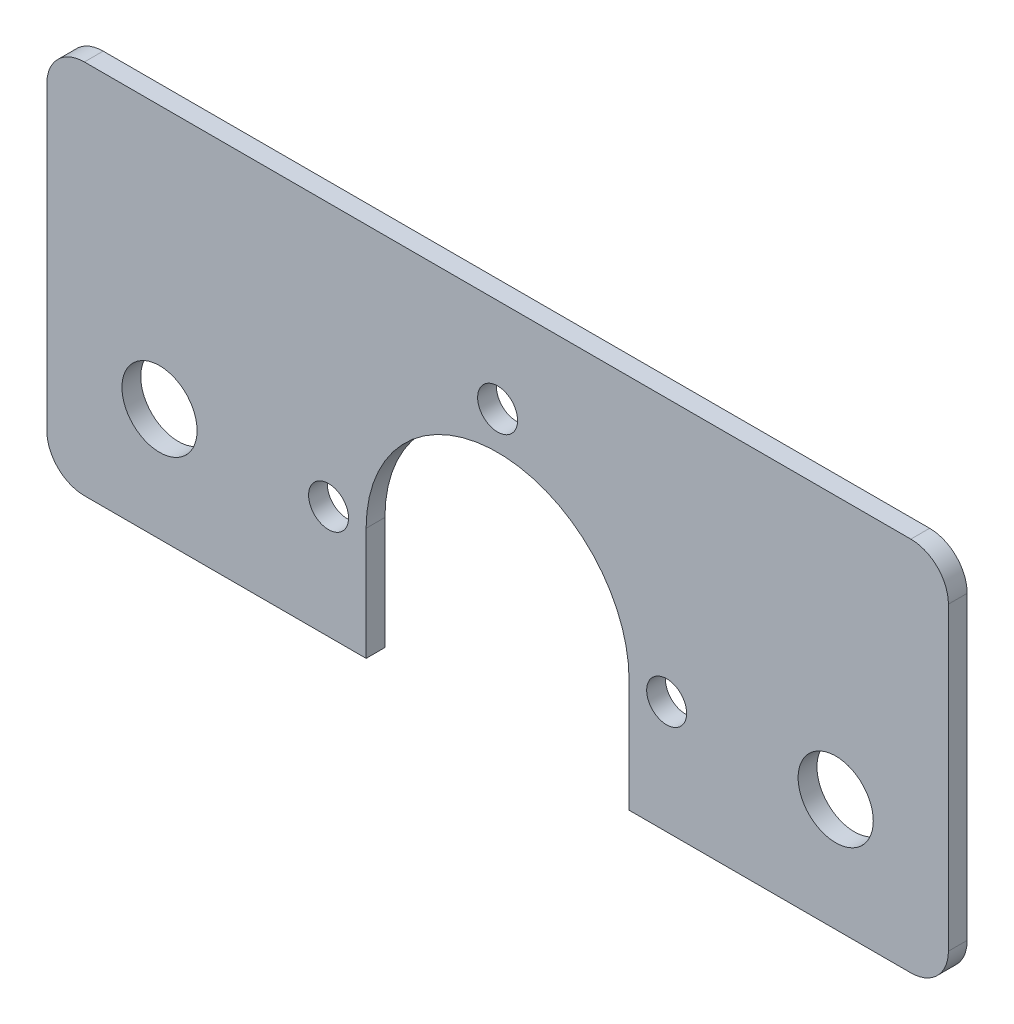
ISO-10303-21;
HEADER;
FILE_DESCRIPTION(('STEP AP214'),'2;1');
FILE_NAME('part.step','',(''),(''),'','','');
FILE_SCHEMA(('AUTOMOTIVE_DESIGN { 1 0 10303 214 1 1 1 1 }'));
ENDSEC;
DATA;
#1=APPLICATION_CONTEXT('core data for automotive mechanical design processes');
#2=APPLICATION_PROTOCOL_DEFINITION('international standard','automotive_design',2000,#1);
#3=PRODUCT_CONTEXT('',#1,'mechanical');
#4=PRODUCT('Part','Part','',(#3));
#5=PRODUCT_RELATED_PRODUCT_CATEGORY('part','',(#4));
#6=PRODUCT_DEFINITION_FORMATION('','',#4);
#7=PRODUCT_DEFINITION_CONTEXT('part definition',#1,'design');
#8=PRODUCT_DEFINITION('design','',#6,#7);
#9=PRODUCT_DEFINITION_SHAPE('','',#8);
#10=(LENGTH_UNIT() NAMED_UNIT(*) SI_UNIT(.MILLI.,.METRE.));
#11=(NAMED_UNIT(*) PLANE_ANGLE_UNIT() SI_UNIT($,.RADIAN.));
#12=(NAMED_UNIT(*) SI_UNIT($,.STERADIAN.) SOLID_ANGLE_UNIT());
#13=UNCERTAINTY_MEASURE_WITH_UNIT(LENGTH_MEASURE(1.E-05),#10,'distance_accuracy_value','');
#14=(GEOMETRIC_REPRESENTATION_CONTEXT(3) GLOBAL_UNCERTAINTY_ASSIGNED_CONTEXT((#13)) GLOBAL_UNIT_ASSIGNED_CONTEXT((#10,
#11,#12)) REPRESENTATION_CONTEXT('',''));
#15=CARTESIAN_POINT('',(0.,0.,0.));
#16=DIRECTION('',(0.,0.,1.));
#17=DIRECTION('',(1.,0.,0.));
#18=AXIS2_PLACEMENT_3D('',#15,#16,#17);
#19=CARTESIAN_POINT('',(0.,0.,3.175));
#20=DIRECTION('',(0.,0.,-1.));
#21=DIRECTION('',(-1.,0.,0.));
#22=AXIS2_PLACEMENT_3D('',#19,#20,#21);
#23=CYLINDRICAL_SURFACE('',#22,22.225);
#24=CARTESIAN_POINT('',(0.,0.,3.175));
#25=DIRECTION('',(0.,0.,1.));
#26=DIRECTION('',(1.,0.,0.));
#27=AXIS2_PLACEMENT_3D('',#24,#25,#26);
#28=CIRCLE('',#27,22.225);
#29=CARTESIAN_POINT('',(22.225,0.,3.175));
#30=VERTEX_POINT('',#29);
#31=CARTESIAN_POINT('',(-22.225,0.,3.175));
#32=VERTEX_POINT('',#31);
#33=EDGE_CURVE('E172',#30,#32,#28,.T.);
#34=ORIENTED_EDGE('',*,*,#33,.T.);
#35=DIRECTION('',(0.,0.,1.));
#36=VECTOR('',#35,1.);
#37=CARTESIAN_POINT('',(-22.225,0.,0.));
#38=LINE('',#37,#36);
#39=CARTESIAN_POINT('',(-22.225,0.,0.));
#40=VERTEX_POINT('',#39);
#41=EDGE_CURVE('E157',#40,#32,#38,.T.);
#42=ORIENTED_EDGE('',*,*,#41,.F.);
#43=CARTESIAN_POINT('',(0.,0.,0.));
#44=DIRECTION('',(0.,0.,1.));
#45=DIRECTION('',(1.,0.,0.));
#46=AXIS2_PLACEMENT_3D('',#43,#44,#45);
#47=CIRCLE('',#46,22.225);
#48=CARTESIAN_POINT('',(22.225,0.,0.));
#49=VERTEX_POINT('',#48);
#50=EDGE_CURVE('E168',#49,#40,#47,.T.);
#51=ORIENTED_EDGE('',*,*,#50,.F.);
#52=DIRECTION('',(0.,0.,1.));
#53=VECTOR('',#52,1.);
#54=CARTESIAN_POINT('',(22.225,0.,0.));
#55=LINE('',#54,#53);
#56=EDGE_CURVE('E169',#49,#30,#55,.T.);
#57=ORIENTED_EDGE('',*,*,#56,.T.);
#58=EDGE_LOOP('',(#34,#42,#51,#57));
#59=FACE_BOUND('',#58,.T.);
#60=ADVANCED_FACE('F40',(#59),#23,.F.);
#61=CARTESIAN_POINT('',(0.,0.,3.175));
#62=DIRECTION('',(0.,0.,1.));
#63=DIRECTION('',(1.,0.,0.));
#64=AXIS2_PLACEMENT_3D('',#61,#62,#63);
#65=PLANE('',#64);
#66=DIRECTION('',(-1.,0.,0.));
#67=VECTOR('',#66,1.);
#68=CARTESIAN_POINT('',(-76.2,-19.05,3.175));
#69=LINE('',#68,#67);
#70=CARTESIAN_POINT('',(69.85,-19.05,3.175));
#71=VERTEX_POINT('',#70);
#72=CARTESIAN_POINT('',(22.225,-19.05,3.175));
#73=VERTEX_POINT('',#72);
#74=EDGE_CURVE('E153',#71,#73,#69,.T.);
#75=ORIENTED_EDGE('',*,*,#74,.F.);
#76=CARTESIAN_POINT('',(69.8500000000001,-12.7,3.175));
#77=DIRECTION('',(0.,0.,1.));
#78=DIRECTION('',(1.,0.,0.));
#79=AXIS2_PLACEMENT_3D('',#76,#77,#78);
#80=CIRCLE('',#79,6.35);
#81=CARTESIAN_POINT('',(76.2,-12.7,3.175));
#82=VERTEX_POINT('',#81);
#83=EDGE_CURVE('E233',#71,#82,#80,.T.);
#84=ORIENTED_EDGE('',*,*,#83,.T.);
#85=DIRECTION('',(0.,1.,0.));
#86=VECTOR('',#85,1.);
#87=CARTESIAN_POINT('',(76.2,0.,3.175));
#88=LINE('',#87,#86);
#89=CARTESIAN_POINT('',(76.2,38.1,3.175));
#90=VERTEX_POINT('',#89);
#91=EDGE_CURVE('E174',#82,#90,#88,.T.);
#92=ORIENTED_EDGE('',*,*,#91,.T.);
#93=CARTESIAN_POINT('',(69.8500000000001,38.1,3.175));
#94=DIRECTION('',(0.,0.,1.));
#95=DIRECTION('',(1.,0.,0.));
#96=AXIS2_PLACEMENT_3D('',#93,#94,#95);
#97=CIRCLE('',#96,6.35);
#98=CARTESIAN_POINT('',(69.8500000000001,44.45,3.175));
#99=VERTEX_POINT('',#98);
#100=EDGE_CURVE('E231',#90,#99,#97,.T.);
#101=ORIENTED_EDGE('',*,*,#100,.T.);
#102=DIRECTION('',(1.,0.,0.));
#103=VECTOR('',#102,1.);
#104=CARTESIAN_POINT('',(0.,44.45,3.175));
#105=LINE('',#104,#103);
#106=CARTESIAN_POINT('',(-69.85,44.45,3.175));
#107=VERTEX_POINT('',#106);
#108=EDGE_CURVE('E178',#107,#99,#105,.T.);
#109=ORIENTED_EDGE('',*,*,#108,.F.);
#110=CARTESIAN_POINT('',(-69.85,38.1,3.175));
#111=DIRECTION('',(0.,0.,1.));
#112=DIRECTION('',(1.,0.,0.));
#113=AXIS2_PLACEMENT_3D('',#110,#111,#112);
#114=CIRCLE('',#113,6.35);
#115=CARTESIAN_POINT('',(-76.2,38.1,3.175));
#116=VERTEX_POINT('',#115);
#117=EDGE_CURVE('E228',#107,#116,#114,.T.);
#118=ORIENTED_EDGE('',*,*,#117,.T.);
#119=DIRECTION('',(0.,1.,0.));
#120=VECTOR('',#119,1.);
#121=CARTESIAN_POINT('',(-76.2,0.,3.175));
#122=LINE('',#121,#120);
#123=CARTESIAN_POINT('',(-76.2,-12.7,3.175));
#124=VERTEX_POINT('',#123);
#125=EDGE_CURVE('E181',#124,#116,#122,.T.);
#126=ORIENTED_EDGE('',*,*,#125,.F.);
#127=CARTESIAN_POINT('',(-69.85,-12.7,3.175));
#128=DIRECTION('',(0.,0.,1.));
#129=DIRECTION('',(1.,0.,0.));
#130=AXIS2_PLACEMENT_3D('',#127,#128,#129);
#131=CIRCLE('',#130,6.35);
#132=CARTESIAN_POINT('',(-69.85,-19.05,3.175));
#133=VERTEX_POINT('',#132);
#134=EDGE_CURVE('E152',#124,#133,#131,.T.);
#135=ORIENTED_EDGE('',*,*,#134,.T.);
#136=CARTESIAN_POINT('',(-22.225,-19.05,3.175));
#137=VERTEX_POINT('',#136);
#138=EDGE_CURVE('E133',#137,#133,#69,.T.);
#139=ORIENTED_EDGE('',*,*,#138,.F.);
#140=DIRECTION('',(0.,-1.,0.));
#141=VECTOR('',#140,1.);
#142=CARTESIAN_POINT('',(-22.225,0.,3.175));
#143=LINE('',#142,#141);
#144=EDGE_CURVE('E149',#32,#137,#143,.T.);
#145=ORIENTED_EDGE('',*,*,#144,.F.);
#146=ORIENTED_EDGE('',*,*,#33,.F.);
#147=DIRECTION('',(0.,-1.,0.));
#148=VECTOR('',#147,1.);
#149=CARTESIAN_POINT('',(22.225,0.,3.175));
#150=LINE('',#149,#148);
#151=EDGE_CURVE('E140',#30,#73,#150,.T.);
#152=ORIENTED_EDGE('',*,*,#151,.T.);
#153=EDGE_LOOP('',(#75,#84,#92,#101,#109,#118,#126,#135,#139,#145,#146,#152));
#154=FACE_BOUND('',#153,.T.);
#155=CARTESIAN_POINT('',(57.15,0.,3.175));
#156=DIRECTION('',(0.,0.,1.));
#157=DIRECTION('',(1.,0.,0.));
#158=AXIS2_PLACEMENT_3D('',#155,#156,#157);
#159=CIRCLE('',#158,6.35000000000002);
#160=CARTESIAN_POINT('',(63.5,0.,3.175));
#161=VERTEX_POINT('',#160);
#162=EDGE_CURVE('E196',#161,#161,#159,.F.);
#163=ORIENTED_EDGE('',*,*,#162,.T.);
#164=EDGE_LOOP('',(#163));
#165=FACE_BOUND('',#164,.T.);
#166=CARTESIAN_POINT('',(-57.15,0.,3.175));
#167=DIRECTION('',(0.,0.,1.));
#168=DIRECTION('',(1.,0.,0.));
#169=AXIS2_PLACEMENT_3D('',#166,#167,#168);
#170=CIRCLE('',#169,6.35);
#171=CARTESIAN_POINT('',(-50.8,0.,3.175));
#172=VERTEX_POINT('',#171);
#173=EDGE_CURVE('E193',#172,#172,#170,.T.);
#174=ORIENTED_EDGE('',*,*,#173,.F.);
#175=EDGE_LOOP('',(#174));
#176=FACE_BOUND('',#175,.T.);
#177=CARTESIAN_POINT('',(28.575,0.,3.175));
#178=DIRECTION('',(0.,0.,1.));
#179=DIRECTION('',(1.,0.,0.));
#180=AXIS2_PLACEMENT_3D('',#177,#178,#179);
#181=CIRCLE('',#180,3.37820000000001);
#182=CARTESIAN_POINT('',(31.9532,0.,3.175));
#183=VERTEX_POINT('',#182);
#184=EDGE_CURVE('E190',#183,#183,#181,.T.);
#185=ORIENTED_EDGE('',*,*,#184,.F.);
#186=EDGE_LOOP('',(#185));
#187=FACE_BOUND('',#186,.T.);
#188=CARTESIAN_POINT('',(0.,28.575,3.175));
#189=DIRECTION('',(0.,0.,1.));
#190=DIRECTION('',(1.,0.,0.));
#191=AXIS2_PLACEMENT_3D('',#188,#189,#190);
#192=CIRCLE('',#191,3.37820000000001);
#193=CARTESIAN_POINT('',(3.37820000000002,28.575,3.175));
#194=VERTEX_POINT('',#193);
#195=EDGE_CURVE('E187',#194,#194,#192,.T.);
#196=ORIENTED_EDGE('',*,*,#195,.F.);
#197=EDGE_LOOP('',(#196));
#198=FACE_BOUND('',#197,.T.);
#199=CARTESIAN_POINT('',(-28.575,0.,3.175));
#200=DIRECTION('',(0.,0.,1.));
#201=DIRECTION('',(1.,0.,0.));
#202=AXIS2_PLACEMENT_3D('',#199,#200,#201);
#203=CIRCLE('',#202,3.37820000000001);
#204=CARTESIAN_POINT('',(-25.1968,0.,3.175));
#205=VERTEX_POINT('',#204);
#206=EDGE_CURVE('E184',#205,#205,#203,.T.);
#207=ORIENTED_EDGE('',*,*,#206,.F.);
#208=EDGE_LOOP('',(#207));
#209=FACE_BOUND('',#208,.T.);
#210=ADVANCED_FACE('F146',(#154,#165,#176,#187,#198,#209),#65,.T.);
#211=CARTESIAN_POINT('',(0.,0.,0.));
#212=DIRECTION('',(0.,0.,1.));
#213=DIRECTION('',(1.,0.,0.));
#214=AXIS2_PLACEMENT_3D('',#211,#212,#213);
#215=PLANE('',#214);
#216=CARTESIAN_POINT('',(57.15,0.,0.));
#217=DIRECTION('',(0.,0.,1.));
#218=DIRECTION('',(1.,0.,0.));
#219=AXIS2_PLACEMENT_3D('',#216,#217,#218);
#220=CIRCLE('',#219,6.35000000000002);
#221=CARTESIAN_POINT('',(63.5,0.,0.));
#222=VERTEX_POINT('',#221);
#223=EDGE_CURVE('E175',#222,#222,#220,.F.);
#224=ORIENTED_EDGE('',*,*,#223,.F.);
#225=EDGE_LOOP('',(#224));
#226=FACE_BOUND('',#225,.T.);
#227=CARTESIAN_POINT('',(-57.15,0.,0.));
#228=DIRECTION('',(0.,0.,1.));
#229=DIRECTION('',(1.,0.,0.));
#230=AXIS2_PLACEMENT_3D('',#227,#228,#229);
#231=CIRCLE('',#230,6.35);
#232=CARTESIAN_POINT('',(-50.8,0.,0.));
#233=VERTEX_POINT('',#232);
#234=EDGE_CURVE('E218',#233,#233,#231,.T.);
#235=ORIENTED_EDGE('',*,*,#234,.T.);
#236=EDGE_LOOP('',(#235));
#237=FACE_BOUND('',#236,.T.);
#238=CARTESIAN_POINT('',(28.575,0.,0.));
#239=DIRECTION('',(0.,0.,1.));
#240=DIRECTION('',(1.,0.,0.));
#241=AXIS2_PLACEMENT_3D('',#238,#239,#240);
#242=CIRCLE('',#241,3.37820000000001);
#243=CARTESIAN_POINT('',(31.9532,0.,0.));
#244=VERTEX_POINT('',#243);
#245=EDGE_CURVE('E215',#244,#244,#242,.T.);
#246=ORIENTED_EDGE('',*,*,#245,.T.);
#247=EDGE_LOOP('',(#246));
#248=FACE_BOUND('',#247,.T.);
#249=CARTESIAN_POINT('',(0.,28.575,0.));
#250=DIRECTION('',(0.,0.,1.));
#251=DIRECTION('',(1.,0.,0.));
#252=AXIS2_PLACEMENT_3D('',#249,#250,#251);
#253=CIRCLE('',#252,3.37820000000001);
#254=CARTESIAN_POINT('',(3.37820000000002,28.575,0.));
#255=VERTEX_POINT('',#254);
#256=EDGE_CURVE('E212',#255,#255,#253,.T.);
#257=ORIENTED_EDGE('',*,*,#256,.T.);
#258=EDGE_LOOP('',(#257));
#259=FACE_BOUND('',#258,.T.);
#260=CARTESIAN_POINT('',(-28.575,0.,0.));
#261=DIRECTION('',(0.,0.,1.));
#262=DIRECTION('',(1.,0.,0.));
#263=AXIS2_PLACEMENT_3D('',#260,#261,#262);
#264=CIRCLE('',#263,3.37820000000001);
#265=CARTESIAN_POINT('',(-25.1968,0.,0.));
#266=VERTEX_POINT('',#265);
#267=EDGE_CURVE('E209',#266,#266,#264,.T.);
#268=ORIENTED_EDGE('',*,*,#267,.T.);
#269=EDGE_LOOP('',(#268));
#270=FACE_BOUND('',#269,.T.);
#271=DIRECTION('',(0.,1.,0.));
#272=VECTOR('',#271,1.);
#273=CARTESIAN_POINT('',(76.2,0.,0.));
#274=LINE('',#273,#272);
#275=CARTESIAN_POINT('',(76.2,-12.7,0.));
#276=VERTEX_POINT('',#275);
#277=CARTESIAN_POINT('',(76.2,38.1,0.));
#278=VERTEX_POINT('',#277);
#279=EDGE_CURVE('E202',#276,#278,#274,.T.);
#280=ORIENTED_EDGE('',*,*,#279,.F.);
#281=CARTESIAN_POINT('',(69.8500000000001,-12.7,0.));
#282=DIRECTION('',(0.,0.,1.));
#283=DIRECTION('',(1.,0.,0.));
#284=AXIS2_PLACEMENT_3D('',#281,#282,#283);
#285=CIRCLE('',#284,6.35);
#286=CARTESIAN_POINT('',(69.85,-19.05,0.));
#287=VERTEX_POINT('',#286);
#288=EDGE_CURVE('E243',#276,#287,#285,.F.);
#289=ORIENTED_EDGE('',*,*,#288,.T.);
#290=DIRECTION('',(-1.,0.,0.));
#291=VECTOR('',#290,1.);
#292=CARTESIAN_POINT('',(-76.2,-19.05,0.));
#293=LINE('',#292,#291);
#294=CARTESIAN_POINT('',(22.2249999999999,-19.05,0.));
#295=VERTEX_POINT('',#294);
#296=EDGE_CURVE('E141',#287,#295,#293,.T.);
#297=ORIENTED_EDGE('',*,*,#296,.T.);
#298=DIRECTION('',(0.,-1.,0.));
#299=VECTOR('',#298,1.);
#300=CARTESIAN_POINT('',(22.225,0.,0.));
#301=LINE('',#300,#299);
#302=EDGE_CURVE('E158',#49,#295,#301,.T.);
#303=ORIENTED_EDGE('',*,*,#302,.F.);
#304=ORIENTED_EDGE('',*,*,#50,.T.);
#305=DIRECTION('',(0.,-1.,0.));
#306=VECTOR('',#305,1.);
#307=CARTESIAN_POINT('',(-22.225,0.,0.));
#308=LINE('',#307,#306);
#309=CARTESIAN_POINT('',(-22.225,-19.05,0.));
#310=VERTEX_POINT('',#309);
#311=EDGE_CURVE('E161',#40,#310,#308,.T.);
#312=ORIENTED_EDGE('',*,*,#311,.T.);
#313=CARTESIAN_POINT('',(-69.85,-19.05,0.));
#314=VERTEX_POINT('',#313);
#315=EDGE_CURVE('E136',#310,#314,#293,.T.);
#316=ORIENTED_EDGE('',*,*,#315,.T.);
#317=CARTESIAN_POINT('',(-69.85,-12.7,0.));
#318=DIRECTION('',(0.,0.,1.));
#319=DIRECTION('',(1.,0.,0.));
#320=AXIS2_PLACEMENT_3D('',#317,#318,#319);
#321=CIRCLE('',#320,6.35);
#322=CARTESIAN_POINT('',(-76.2,-12.7,0.));
#323=VERTEX_POINT('',#322);
#324=EDGE_CURVE('E240',#314,#323,#321,.F.);
#325=ORIENTED_EDGE('',*,*,#324,.T.);
#326=DIRECTION('',(0.,1.,0.));
#327=VECTOR('',#326,1.);
#328=CARTESIAN_POINT('',(-76.2,0.,0.));
#329=LINE('',#328,#327);
#330=CARTESIAN_POINT('',(-76.2,38.1,0.));
#331=VERTEX_POINT('',#330);
#332=EDGE_CURVE('E207',#323,#331,#329,.T.);
#333=ORIENTED_EDGE('',*,*,#332,.T.);
#334=CARTESIAN_POINT('',(-69.85,38.1,0.));
#335=DIRECTION('',(0.,0.,1.));
#336=DIRECTION('',(1.,0.,0.));
#337=AXIS2_PLACEMENT_3D('',#334,#335,#336);
#338=CIRCLE('',#337,6.35);
#339=CARTESIAN_POINT('',(-69.85,44.45,0.));
#340=VERTEX_POINT('',#339);
#341=EDGE_CURVE('E63',#331,#340,#338,.F.);
#342=ORIENTED_EDGE('',*,*,#341,.T.);
#343=DIRECTION('',(1.,0.,0.));
#344=VECTOR('',#343,1.);
#345=CARTESIAN_POINT('',(0.,44.45,0.));
#346=LINE('',#345,#344);
#347=CARTESIAN_POINT('',(69.8500000000001,44.45,0.));
#348=VERTEX_POINT('',#347);
#349=EDGE_CURVE('E205',#340,#348,#346,.T.);
#350=ORIENTED_EDGE('',*,*,#349,.T.);
#351=CARTESIAN_POINT('',(69.8500000000001,38.1,0.));
#352=DIRECTION('',(0.,0.,1.));
#353=DIRECTION('',(1.,0.,0.));
#354=AXIS2_PLACEMENT_3D('',#351,#352,#353);
#355=CIRCLE('',#354,6.35);
#356=EDGE_CURVE('E55',#348,#278,#355,.F.);
#357=ORIENTED_EDGE('',*,*,#356,.T.);
#358=EDGE_LOOP('',(#280,#289,#297,#303,#304,#312,#316,#325,#333,#342,#350,#357));
#359=FACE_BOUND('',#358,.T.);
#360=ADVANCED_FACE('F264',(#226,#237,#248,#259,#270,#359),#215,.F.);
#361=CARTESIAN_POINT('',(76.2,0.,3.175));
#362=DIRECTION('',(-1.,0.,0.));
#363=DIRECTION('',(0.,0.,1.));
#364=AXIS2_PLACEMENT_3D('',#361,#362,#363);
#365=PLANE('',#364);
#366=ORIENTED_EDGE('',*,*,#91,.F.);
#367=DIRECTION('',(0.,0.,1.));
#368=VECTOR('',#367,1.);
#369=CARTESIAN_POINT('',(76.2,-12.7,3.175));
#370=LINE('',#369,#368);
#371=EDGE_CURVE('E237',#82,#276,#370,.F.);
#372=ORIENTED_EDGE('',*,*,#371,.T.);
#373=ORIENTED_EDGE('',*,*,#279,.T.);
#374=DIRECTION('',(0.,0.,-1.));
#375=VECTOR('',#374,1.);
#376=CARTESIAN_POINT('',(76.2,38.1,3.175));
#377=LINE('',#376,#375);
#378=EDGE_CURVE('E235',#278,#90,#377,.F.);
#379=ORIENTED_EDGE('',*,*,#378,.T.);
#380=EDGE_LOOP('',(#366,#372,#373,#379));
#381=FACE_BOUND('',#380,.T.);
#382=ADVANCED_FACE('F283',(#381),#365,.F.);
#383=CARTESIAN_POINT('',(0.,44.45,3.175));
#384=DIRECTION('',(0.,1.,0.));
#385=DIRECTION('',(0.,0.,1.));
#386=AXIS2_PLACEMENT_3D('',#383,#384,#385);
#387=PLANE('',#386);
#388=ORIENTED_EDGE('',*,*,#108,.T.);
#389=DIRECTION('',(0.,0.,-1.));
#390=VECTOR('',#389,1.);
#391=CARTESIAN_POINT('',(69.8500000000001,44.45,0.));
#392=LINE('',#391,#390);
#393=EDGE_CURVE('E247',#99,#348,#392,.T.);
#394=ORIENTED_EDGE('',*,*,#393,.T.);
#395=ORIENTED_EDGE('',*,*,#349,.F.);
#396=DIRECTION('',(0.,0.,-1.));
#397=VECTOR('',#396,1.);
#398=CARTESIAN_POINT('',(-69.85,44.45,3.175));
#399=LINE('',#398,#397);
#400=EDGE_CURVE('E245',#340,#107,#399,.F.);
#401=ORIENTED_EDGE('',*,*,#400,.T.);
#402=EDGE_LOOP('',(#388,#394,#395,#401));
#403=FACE_BOUND('',#402,.T.);
#404=ADVANCED_FACE('F322',(#403),#387,.T.);
#405=CARTESIAN_POINT('',(-57.15,0.,3.175));
#406=DIRECTION('',(0.,0.,-1.));
#407=DIRECTION('',(-1.,0.,0.));
#408=AXIS2_PLACEMENT_3D('',#405,#406,#407);
#409=CYLINDRICAL_SURFACE('',#408,6.35);
#410=ORIENTED_EDGE('',*,*,#173,.T.);
#411=EDGE_LOOP('',(#410));
#412=FACE_BOUND('',#411,.T.);
#413=ORIENTED_EDGE('',*,*,#234,.F.);
#414=EDGE_LOOP('',(#413));
#415=FACE_BOUND('',#414,.T.);
#416=ADVANCED_FACE('F318',(#412,#415),#409,.F.);
#417=CARTESIAN_POINT('',(28.575,0.,3.175));
#418=DIRECTION('',(0.,0.,-1.));
#419=DIRECTION('',(-1.,0.,0.));
#420=AXIS2_PLACEMENT_3D('',#417,#418,#419);
#421=CYLINDRICAL_SURFACE('',#420,3.37820000000001);
#422=ORIENTED_EDGE('',*,*,#184,.T.);
#423=EDGE_LOOP('',(#422));
#424=FACE_BOUND('',#423,.T.);
#425=ORIENTED_EDGE('',*,*,#245,.F.);
#426=EDGE_LOOP('',(#425));
#427=FACE_BOUND('',#426,.T.);
#428=ADVANCED_FACE('F321',(#424,#427),#421,.F.);
#429=CARTESIAN_POINT('',(0.,28.575,3.175));
#430=DIRECTION('',(0.,0.,-1.));
#431=DIRECTION('',(-1.,0.,0.));
#432=AXIS2_PLACEMENT_3D('',#429,#430,#431);
#433=CYLINDRICAL_SURFACE('',#432,3.37820000000001);
#434=ORIENTED_EDGE('',*,*,#195,.T.);
#435=EDGE_LOOP('',(#434));
#436=FACE_BOUND('',#435,.T.);
#437=ORIENTED_EDGE('',*,*,#256,.F.);
#438=EDGE_LOOP('',(#437));
#439=FACE_BOUND('',#438,.T.);
#440=ADVANCED_FACE('F326',(#436,#439),#433,.F.);
#441=CARTESIAN_POINT('',(-28.575,0.,3.175));
#442=DIRECTION('',(0.,0.,-1.));
#443=DIRECTION('',(-1.,0.,0.));
#444=AXIS2_PLACEMENT_3D('',#441,#442,#443);
#445=CYLINDRICAL_SURFACE('',#444,3.37820000000001);
#446=ORIENTED_EDGE('',*,*,#206,.T.);
#447=EDGE_LOOP('',(#446));
#448=FACE_BOUND('',#447,.T.);
#449=ORIENTED_EDGE('',*,*,#267,.F.);
#450=EDGE_LOOP('',(#449));
#451=FACE_BOUND('',#450,.T.);
#452=ADVANCED_FACE('F330',(#448,#451),#445,.F.);
#453=CARTESIAN_POINT('',(-76.2,0.,3.175));
#454=DIRECTION('',(-1.,0.,0.));
#455=DIRECTION('',(0.,0.,1.));
#456=AXIS2_PLACEMENT_3D('',#453,#454,#455);
#457=PLANE('',#456);
#458=ORIENTED_EDGE('',*,*,#332,.F.);
#459=DIRECTION('',(0.,0.,1.));
#460=VECTOR('',#459,1.);
#461=CARTESIAN_POINT('',(-76.2,-12.7,3.175));
#462=LINE('',#461,#460);
#463=EDGE_CURVE('E48',#323,#124,#462,.T.);
#464=ORIENTED_EDGE('',*,*,#463,.T.);
#465=ORIENTED_EDGE('',*,*,#125,.T.);
#466=DIRECTION('',(0.,0.,-1.));
#467=VECTOR('',#466,1.);
#468=CARTESIAN_POINT('',(-76.2,38.1,3.175));
#469=LINE('',#468,#467);
#470=EDGE_CURVE('E249',#116,#331,#469,.T.);
#471=ORIENTED_EDGE('',*,*,#470,.T.);
#472=EDGE_LOOP('',(#458,#464,#465,#471));
#473=FACE_BOUND('',#472,.T.);
#474=ADVANCED_FACE('F255',(#473),#457,.T.);
#475=CARTESIAN_POINT('',(57.15,0.,3.175));
#476=DIRECTION('',(0.,0.,-1.));
#477=DIRECTION('',(-1.,0.,0.));
#478=AXIS2_PLACEMENT_3D('',#475,#476,#477);
#479=CYLINDRICAL_SURFACE('',#478,6.35000000000002);
#480=ORIENTED_EDGE('',*,*,#162,.F.);
#481=EDGE_LOOP('',(#480));
#482=FACE_BOUND('',#481,.T.);
#483=ORIENTED_EDGE('',*,*,#223,.T.);
#484=EDGE_LOOP('',(#483));
#485=FACE_BOUND('',#484,.T.);
#486=ADVANCED_FACE('F309',(#482,#485),#479,.F.);
#487=CARTESIAN_POINT('',(-22.225,0.,0.));
#488=DIRECTION('',(-1.,0.,0.));
#489=DIRECTION('',(0.,-1.,0.));
#490=AXIS2_PLACEMENT_3D('',#487,#488,#489);
#491=PLANE('',#490);
#492=ORIENTED_EDGE('',*,*,#144,.T.);
#493=DIRECTION('',(0.,0.,-1.));
#494=VECTOR('',#493,1.);
#495=CARTESIAN_POINT('',(-22.225,-19.05,0.));
#496=LINE('',#495,#494);
#497=EDGE_CURVE('E130',#137,#310,#496,.T.);
#498=ORIENTED_EDGE('',*,*,#497,.T.);
#499=ORIENTED_EDGE('',*,*,#311,.F.);
#500=ORIENTED_EDGE('',*,*,#41,.T.);
#501=EDGE_LOOP('',(#492,#498,#499,#500));
#502=FACE_BOUND('',#501,.T.);
#503=ADVANCED_FACE('F155',(#502),#491,.F.);
#504=CARTESIAN_POINT('',(22.225,0.,0.));
#505=DIRECTION('',(-1.,0.,0.));
#506=DIRECTION('',(0.,-1.,0.));
#507=AXIS2_PLACEMENT_3D('',#504,#505,#506);
#508=PLANE('',#507);
#509=DIRECTION('',(0.,0.,-1.));
#510=VECTOR('',#509,1.);
#511=CARTESIAN_POINT('',(22.225,-19.05,0.));
#512=LINE('',#511,#510);
#513=EDGE_CURVE('E199',#73,#295,#512,.T.);
#514=ORIENTED_EDGE('',*,*,#513,.F.);
#515=ORIENTED_EDGE('',*,*,#151,.F.);
#516=ORIENTED_EDGE('',*,*,#56,.F.);
#517=ORIENTED_EDGE('',*,*,#302,.T.);
#518=EDGE_LOOP('',(#514,#515,#516,#517));
#519=FACE_BOUND('',#518,.T.);
#520=ADVANCED_FACE('F302',(#519),#508,.T.);
#521=CARTESIAN_POINT('',(-76.2,-19.05,0.));
#522=DIRECTION('',(0.,1.,0.));
#523=DIRECTION('',(0.,0.,1.));
#524=AXIS2_PLACEMENT_3D('',#521,#522,#523);
#525=PLANE('',#524);
#526=ORIENTED_EDGE('',*,*,#296,.F.);
#527=DIRECTION('',(0.,0.,1.));
#528=VECTOR('',#527,1.);
#529=CARTESIAN_POINT('',(69.8500000000001,-19.05,0.));
#530=LINE('',#529,#528);
#531=EDGE_CURVE('E225',#287,#71,#530,.T.);
#532=ORIENTED_EDGE('',*,*,#531,.T.);
#533=ORIENTED_EDGE('',*,*,#74,.T.);
#534=ORIENTED_EDGE('',*,*,#513,.T.);
#535=EDGE_LOOP('',(#526,#532,#533,#534));
#536=FACE_BOUND('',#535,.T.);
#537=ADVANCED_FACE('F290',(#536),#525,.F.);
#538=ORIENTED_EDGE('',*,*,#138,.T.);
#539=DIRECTION('',(0.,0.,1.));
#540=VECTOR('',#539,1.);
#541=CARTESIAN_POINT('',(-69.85,-19.05,0.));
#542=LINE('',#541,#540);
#543=EDGE_CURVE('E11',#133,#314,#542,.F.);
#544=ORIENTED_EDGE('',*,*,#543,.T.);
#545=ORIENTED_EDGE('',*,*,#315,.F.);
#546=ORIENTED_EDGE('',*,*,#497,.F.);
#547=EDGE_LOOP('',(#538,#544,#545,#546));
#548=FACE_BOUND('',#547,.T.);
#549=ADVANCED_FACE('F132',(#548),#525,.F.);
#550=CARTESIAN_POINT('',(69.8500000000001,-12.7,0.));
#551=DIRECTION('',(0.,0.,1.));
#552=DIRECTION('',(1.,0.,0.));
#553=AXIS2_PLACEMENT_3D('',#550,#551,#552);
#554=CYLINDRICAL_SURFACE('',#553,6.35);
#555=ORIENTED_EDGE('',*,*,#288,.F.);
#556=ORIENTED_EDGE('',*,*,#371,.F.);
#557=ORIENTED_EDGE('',*,*,#83,.F.);
#558=ORIENTED_EDGE('',*,*,#531,.F.);
#559=EDGE_LOOP('',(#555,#556,#557,#558));
#560=FACE_BOUND('',#559,.T.);
#561=ADVANCED_FACE('F272',(#560),#554,.T.);
#562=CARTESIAN_POINT('',(69.8500000000001,38.1,3.175));
#563=DIRECTION('',(0.,0.,1.));
#564=DIRECTION('',(1.,0.,0.));
#565=AXIS2_PLACEMENT_3D('',#562,#563,#564);
#566=CYLINDRICAL_SURFACE('',#565,6.35);
#567=ORIENTED_EDGE('',*,*,#100,.F.);
#568=ORIENTED_EDGE('',*,*,#378,.F.);
#569=ORIENTED_EDGE('',*,*,#356,.F.);
#570=ORIENTED_EDGE('',*,*,#393,.F.);
#571=EDGE_LOOP('',(#567,#568,#569,#570));
#572=FACE_BOUND('',#571,.T.);
#573=ADVANCED_FACE('F267',(#572),#566,.T.);
#574=CARTESIAN_POINT('',(-69.85,-12.7,3.175));
#575=DIRECTION('',(0.,0.,-1.));
#576=DIRECTION('',(-1.,0.,0.));
#577=AXIS2_PLACEMENT_3D('',#574,#575,#576);
#578=CYLINDRICAL_SURFACE('',#577,6.35);
#579=ORIENTED_EDGE('',*,*,#324,.F.);
#580=ORIENTED_EDGE('',*,*,#543,.F.);
#581=ORIENTED_EDGE('',*,*,#134,.F.);
#582=ORIENTED_EDGE('',*,*,#463,.F.);
#583=EDGE_LOOP('',(#579,#580,#581,#582));
#584=FACE_BOUND('',#583,.T.);
#585=ADVANCED_FACE('F265',(#584),#578,.T.);
#586=CARTESIAN_POINT('',(-69.85,38.1,3.175));
#587=DIRECTION('',(0.,0.,-1.));
#588=DIRECTION('',(-1.,0.,0.));
#589=AXIS2_PLACEMENT_3D('',#586,#587,#588);
#590=CYLINDRICAL_SURFACE('',#589,6.35);
#591=ORIENTED_EDGE('',*,*,#117,.F.);
#592=ORIENTED_EDGE('',*,*,#400,.F.);
#593=ORIENTED_EDGE('',*,*,#341,.F.);
#594=ORIENTED_EDGE('',*,*,#470,.F.);
#595=EDGE_LOOP('',(#591,#592,#593,#594));
#596=FACE_BOUND('',#595,.T.);
#597=ADVANCED_FACE('F42',(#596),#590,.T.);
#598=CLOSED_SHELL('',(#60,#210,#360,#382,#404,#416,#428,#440,#452,#474,#486,#503,#520,#537,#549,
#561,#573,#585,#597));
#599=MANIFOLD_SOLID_BREP('B2',#598);
#600=ADVANCED_BREP_SHAPE_REPRESENTATION('',(#18,#599),#14);
#601=SHAPE_DEFINITION_REPRESENTATION(#9,#600);
ENDSEC;
END-ISO-10303-21;
